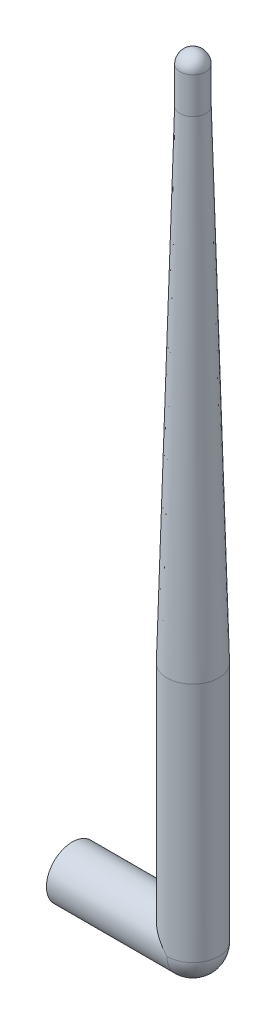
ISO-10303-21;
HEADER;
FILE_DESCRIPTION(('STEP AP214'),'2;1');
FILE_NAME('part.step','',(''),(''),'','','');
FILE_SCHEMA(('AUTOMOTIVE_DESIGN { 1 0 10303 214 1 1 1 1 }'));
ENDSEC;
DATA;
#1=APPLICATION_CONTEXT('core data for automotive mechanical design processes');
#2=APPLICATION_PROTOCOL_DEFINITION('international standard','automotive_design',2000,#1);
#3=PRODUCT_CONTEXT('',#1,'mechanical');
#4=PRODUCT('Part','Part','',(#3));
#5=PRODUCT_RELATED_PRODUCT_CATEGORY('part','',(#4));
#6=PRODUCT_DEFINITION_FORMATION('','',#4);
#7=PRODUCT_DEFINITION_CONTEXT('part definition',#1,'design');
#8=PRODUCT_DEFINITION('design','',#6,#7);
#9=PRODUCT_DEFINITION_SHAPE('','',#8);
#10=(LENGTH_UNIT() NAMED_UNIT(*) SI_UNIT(.MILLI.,.METRE.));
#11=(NAMED_UNIT(*) PLANE_ANGLE_UNIT() SI_UNIT($,.RADIAN.));
#12=(NAMED_UNIT(*) SI_UNIT($,.STERADIAN.) SOLID_ANGLE_UNIT());
#13=UNCERTAINTY_MEASURE_WITH_UNIT(LENGTH_MEASURE(1.E-05),#10,'distance_accuracy_value','');
#14=(GEOMETRIC_REPRESENTATION_CONTEXT(3) GLOBAL_UNCERTAINTY_ASSIGNED_CONTEXT((#13)) GLOBAL_UNIT_ASSIGNED_CONTEXT((#10,
#11,#12)) REPRESENTATION_CONTEXT('',''));
#15=CARTESIAN_POINT('',(0.,0.,0.));
#16=DIRECTION('',(0.,0.,1.));
#17=DIRECTION('',(1.,0.,0.));
#18=AXIS2_PLACEMENT_3D('',#15,#16,#17);
#19=CARTESIAN_POINT('',(25.4,0.,0.));
#20=DIRECTION('',(-1.,0.,0.));
#21=DIRECTION('',(0.,0.,1.));
#22=AXIS2_PLACEMENT_3D('',#19,#20,#21);
#23=CYLINDRICAL_SURFACE('',#22,5.461);
#24=CARTESIAN_POINT('',(0.,0.,0.));
#25=DIRECTION('',(1.,0.,0.));
#26=DIRECTION('',(0.,0.,-1.));
#27=AXIS2_PLACEMENT_3D('',#24,#25,#26);
#28=CIRCLE('',#27,5.461);
#29=CARTESIAN_POINT('',(0.,0.,-5.461));
#30=VERTEX_POINT('',#29);
#31=EDGE_CURVE('E45',#30,#30,#28,.T.);
#32=ORIENTED_EDGE('',*,*,#31,.T.);
#33=EDGE_LOOP('',(#32));
#34=FACE_BOUND('',#33,.T.);
#35=CARTESIAN_POINT('',(25.4,0.,0.));
#36=DIRECTION('',(-0.707106781186547,-0.707106781186547,0.));
#37=DIRECTION('',(-0.707106781186547,0.707106781186547,0.));
#38=AXIS2_PLACEMENT_3D('',#35,#36,#37);
#39=ELLIPSE('',#38,7.72302026411947,5.461);
#40=CARTESIAN_POINT('',(25.4,0.,-5.461));
#41=VERTEX_POINT('',#40);
#42=CARTESIAN_POINT('',(25.4,0.,5.461));
#43=VERTEX_POINT('',#42);
#44=EDGE_CURVE('E59',#41,#43,#39,.F.);
#45=ORIENTED_EDGE('',*,*,#44,.F.);
#46=CARTESIAN_POINT('',(25.4,0.,0.));
#47=DIRECTION('',(1.,0.,0.));
#48=DIRECTION('',(0.,0.,-1.));
#49=AXIS2_PLACEMENT_3D('',#46,#47,#48);
#50=CIRCLE('',#49,5.461);
#51=EDGE_CURVE('E12',#43,#41,#50,.T.);
#52=ORIENTED_EDGE('',*,*,#51,.F.);
#53=EDGE_LOOP('',(#45,#52));
#54=FACE_BOUND('',#53,.T.);
#55=ADVANCED_FACE('F36',(#34,#54),#23,.T.);
#56=CARTESIAN_POINT('',(0.,0.,0.));
#57=DIRECTION('',(1.,0.,0.));
#58=DIRECTION('',(0.,0.,-1.));
#59=AXIS2_PLACEMENT_3D('',#56,#57,#58);
#60=PLANE('',#59);
#61=CARTESIAN_POINT('',(0.,0.,0.));
#62=DIRECTION('',(-1.,0.,0.));
#63=DIRECTION('',(0.,0.,1.));
#64=AXIS2_PLACEMENT_3D('',#61,#62,#63);
#65=CIRCLE('',#64,4.191);
#66=CARTESIAN_POINT('',(0.,0.,4.191));
#67=VERTEX_POINT('',#66);
#68=EDGE_CURVE('E62',#67,#67,#65,.T.);
#69=ORIENTED_EDGE('',*,*,#68,.F.);
#70=EDGE_LOOP('',(#69));
#71=FACE_BOUND('',#70,.T.);
#72=ORIENTED_EDGE('',*,*,#31,.F.);
#73=EDGE_LOOP('',(#72));
#74=FACE_BOUND('',#73,.T.);
#75=ADVANCED_FACE('F65',(#71,#74),#60,.F.);
#76=CARTESIAN_POINT('',(7.62,0.,0.));
#77=DIRECTION('',(-1.,0.,0.));
#78=DIRECTION('',(0.,0.,1.));
#79=AXIS2_PLACEMENT_3D('',#76,#77,#78);
#80=CYLINDRICAL_SURFACE('',#79,4.191);
#81=CARTESIAN_POINT('',(7.62,0.,0.));
#82=DIRECTION('',(-1.,0.,0.));
#83=DIRECTION('',(0.,0.,1.));
#84=AXIS2_PLACEMENT_3D('',#81,#82,#83);
#85=CIRCLE('',#84,4.191);
#86=CARTESIAN_POINT('',(7.62,0.,4.191));
#87=VERTEX_POINT('',#86);
#88=EDGE_CURVE('E75',#87,#87,#85,.T.);
#89=ORIENTED_EDGE('',*,*,#88,.F.);
#90=EDGE_LOOP('',(#89));
#91=FACE_BOUND('',#90,.T.);
#92=ORIENTED_EDGE('',*,*,#68,.T.);
#93=EDGE_LOOP('',(#92));
#94=FACE_BOUND('',#93,.T.);
#95=ADVANCED_FACE('F70',(#91,#94),#80,.F.);
#96=CARTESIAN_POINT('',(7.62,0.,0.));
#97=DIRECTION('',(-1.,0.,0.));
#98=DIRECTION('',(0.,0.,1.));
#99=AXIS2_PLACEMENT_3D('',#96,#97,#98);
#100=PLANE('',#99);
#101=ORIENTED_EDGE('',*,*,#88,.T.);
#102=EDGE_LOOP('',(#101));
#103=FACE_BOUND('',#102,.T.);
#104=ADVANCED_FACE('F124',(#103),#100,.T.);
#105=CARTESIAN_POINT('',(25.4,50.8,0.));
#106=DIRECTION('',(0.,-1.,0.));
#107=DIRECTION('',(0.,0.,-1.));
#108=AXIS2_PLACEMENT_3D('',#105,#106,#107);
#109=CYLINDRICAL_SURFACE('',#108,5.461);
#110=CARTESIAN_POINT('',(25.4,50.8,0.));
#111=DIRECTION('',(0.,-1.,0.));
#112=DIRECTION('',(0.,0.,-1.));
#113=AXIS2_PLACEMENT_3D('',#110,#111,#112);
#114=CIRCLE('',#113,5.461);
#115=CARTESIAN_POINT('',(25.4,50.8,-5.461));
#116=VERTEX_POINT('',#115);
#117=EDGE_CURVE('E57',#116,#116,#114,.F.);
#118=ORIENTED_EDGE('',*,*,#117,.F.);
#119=EDGE_LOOP('',(#118));
#120=FACE_BOUND('',#119,.T.);
#121=CARTESIAN_POINT('',(25.4,0.,0.));
#122=DIRECTION('',(0.,1.,0.));
#123=DIRECTION('',(0.,0.,1.));
#124=AXIS2_PLACEMENT_3D('',#121,#122,#123);
#125=CIRCLE('',#124,5.461);
#126=EDGE_CURVE('E52',#43,#41,#125,.T.);
#127=ORIENTED_EDGE('',*,*,#126,.T.);
#128=ORIENTED_EDGE('',*,*,#44,.T.);
#129=EDGE_LOOP('',(#127,#128));
#130=FACE_BOUND('',#129,.T.);
#131=ADVANCED_FACE('F60',(#120,#130),#109,.T.);
#132=CARTESIAN_POINT('',(25.4,0.,0.));
#133=DIRECTION('',(0.,0.,-1.));
#134=DIRECTION('',(1.,0.,0.));
#135=AXIS2_PLACEMENT_3D('',#132,#133,#134);
#136=SPHERICAL_SURFACE('',#135,5.461);
#137=ORIENTED_EDGE('',*,*,#51,.T.);
#138=ORIENTED_EDGE('',*,*,#126,.F.);
#139=EDGE_LOOP('',(#137,#138));
#140=FACE_BOUND('',#139,.T.);
#141=ADVANCED_FACE('F54',(#140),#136,.T.);
#142=CARTESIAN_POINT('',(25.4,152.4,0.));
#143=DIRECTION('',(0.,-1.,0.));
#144=DIRECTION('',(0.,0.,-1.));
#145=AXIS2_PLACEMENT_3D('',#142,#143,#144);
#146=CONICAL_SURFACE('',#145,2.7305,0.0268685325062938);
#147=ORIENTED_EDGE('',*,*,#117,.T.);
#148=EDGE_LOOP('',(#147));
#149=FACE_BOUND('',#148,.T.);
#150=CARTESIAN_POINT('',(25.4,152.4,0.));
#151=DIRECTION('',(0.,1.,0.));
#152=DIRECTION('',(0.,0.,1.));
#153=AXIS2_PLACEMENT_3D('',#150,#151,#152);
#154=CIRCLE('',#153,2.7305);
#155=CARTESIAN_POINT('',(25.4,152.4,2.7305));
#156=VERTEX_POINT('',#155);
#157=EDGE_CURVE('E39',#156,#156,#154,.T.);
#158=ORIENTED_EDGE('',*,*,#157,.F.);
#159=EDGE_LOOP('',(#158));
#160=FACE_BOUND('',#159,.T.);
#161=ADVANCED_FACE('F102',(#149,#160),#146,.T.);
#162=CARTESIAN_POINT('',(25.4,160.02,0.));
#163=DIRECTION('',(0.,-1.,0.));
#164=DIRECTION('',(0.,0.,-1.));
#165=AXIS2_PLACEMENT_3D('',#162,#163,#164);
#166=CYLINDRICAL_SURFACE('',#165,2.7305);
#167=CARTESIAN_POINT('',(25.4,160.02,0.));
#168=DIRECTION('',(0.,1.,0.));
#169=DIRECTION('',(0.,0.,1.));
#170=AXIS2_PLACEMENT_3D('',#167,#168,#169);
#171=CIRCLE('',#170,2.7305);
#172=CARTESIAN_POINT('',(25.4,160.02,2.7305));
#173=VERTEX_POINT('',#172);
#174=EDGE_CURVE('E140',#173,#173,#171,.T.);
#175=ORIENTED_EDGE('',*,*,#174,.F.);
#176=EDGE_LOOP('',(#175));
#177=FACE_BOUND('',#176,.T.);
#178=ORIENTED_EDGE('',*,*,#157,.T.);
#179=EDGE_LOOP('',(#178));
#180=FACE_BOUND('',#179,.T.);
#181=ADVANCED_FACE('F91',(#177,#180),#166,.T.);
#182=CARTESIAN_POINT('',(25.4,160.02,0.));
#183=DIRECTION('',(0.,0.,-1.));
#184=DIRECTION('',(-1.,0.,0.));
#185=AXIS2_PLACEMENT_3D('',#182,#183,#184);
#186=SPHERICAL_SURFACE('',#185,2.7305);
#187=CARTESIAN_POINT('',(25.4,160.02,0.));
#188=DIRECTION('',(0.,1.,0.));
#189=DIRECTION('',(0.,0.,1.));
#190=AXIS2_PLACEMENT_3D('',#187,#188,#189);
#191=SPHERICAL_SURFACE('',#190,2.7305);
#192=ORIENTED_EDGE('',*,*,#174,.T.);
#193=EDGE_LOOP('',(#192));
#194=FACE_BOUND('',#193,.T.);
#195=ADVANCED_FACE('F101',(#194),#191,.T.);
#196=CLOSED_SHELL('',(#55,#75,#95,#104,#131,#141,#161,#181,#195));
#197=MANIFOLD_SOLID_BREP('B2',#196);
#198=ADVANCED_BREP_SHAPE_REPRESENTATION('',(#18,#197),#14);
#199=SHAPE_DEFINITION_REPRESENTATION(#9,#198);
ENDSEC;
END-ISO-10303-21;
